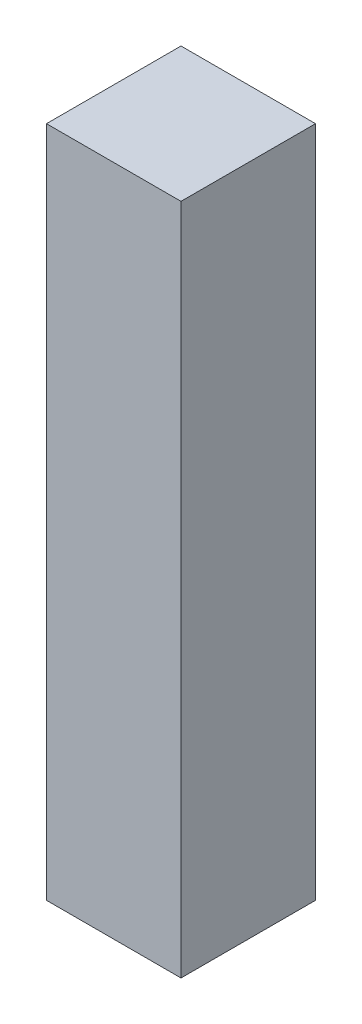
ISO-10303-21;
HEADER;
FILE_DESCRIPTION(('STEP AP214'),'2;1');
FILE_NAME('part.step','',(''),(''),'','','');
FILE_SCHEMA(('AUTOMOTIVE_DESIGN { 1 0 10303 214 1 1 1 1 }'));
ENDSEC;
DATA;
#1=APPLICATION_CONTEXT('core data for automotive mechanical design processes');
#2=APPLICATION_PROTOCOL_DEFINITION('international standard','automotive_design',2000,#1);
#3=PRODUCT_CONTEXT('',#1,'mechanical');
#4=PRODUCT('Part','Part','',(#3));
#5=PRODUCT_RELATED_PRODUCT_CATEGORY('part','',(#4));
#6=PRODUCT_DEFINITION_FORMATION('','',#4);
#7=PRODUCT_DEFINITION_CONTEXT('part definition',#1,'design');
#8=PRODUCT_DEFINITION('design','',#6,#7);
#9=PRODUCT_DEFINITION_SHAPE('','',#8);
#10=(LENGTH_UNIT() NAMED_UNIT(*) SI_UNIT(.MILLI.,.METRE.));
#11=(NAMED_UNIT(*) PLANE_ANGLE_UNIT() SI_UNIT($,.RADIAN.));
#12=(NAMED_UNIT(*) SI_UNIT($,.STERADIAN.) SOLID_ANGLE_UNIT());
#13=UNCERTAINTY_MEASURE_WITH_UNIT(LENGTH_MEASURE(1.E-05),#10,'distance_accuracy_value','');
#14=(GEOMETRIC_REPRESENTATION_CONTEXT(3) GLOBAL_UNCERTAINTY_ASSIGNED_CONTEXT((#13)) GLOBAL_UNIT_ASSIGNED_CONTEXT((#10,
#11,#12)) REPRESENTATION_CONTEXT('',''));
#15=CARTESIAN_POINT('',(0.,0.,0.));
#16=DIRECTION('',(0.,0.,1.));
#17=DIRECTION('',(1.,0.,0.));
#18=AXIS2_PLACEMENT_3D('',#15,#16,#17);
#19=CARTESIAN_POINT('',(-10.2,100.,-8.55));
#20=DIRECTION('',(0.,0.,1.));
#21=DIRECTION('',(1.,0.,0.));
#22=AXIS2_PLACEMENT_3D('',#19,#20,#21);
#23=PLANE('',#22);
#24=DIRECTION('',(-1.,0.,0.));
#25=VECTOR('',#24,1.);
#26=CARTESIAN_POINT('',(-10.2,0.,-8.55));
#27=LINE('',#26,#25);
#28=CARTESIAN_POINT('',(9.79999999999999,0.,-8.55));
#29=VERTEX_POINT('',#28);
#30=CARTESIAN_POINT('',(-10.2,0.,-8.55));
#31=VERTEX_POINT('',#30);
#32=EDGE_CURVE('E100',#29,#31,#27,.T.);
#33=ORIENTED_EDGE('',*,*,#32,.T.);
#34=DIRECTION('',(0.,-1.,0.));
#35=VECTOR('',#34,1.);
#36=CARTESIAN_POINT('',(-10.2,100.,-8.55));
#37=LINE('',#36,#35);
#38=CARTESIAN_POINT('',(-10.2,100.,-8.55));
#39=VERTEX_POINT('',#38);
#40=EDGE_CURVE('E11',#39,#31,#37,.T.);
#41=ORIENTED_EDGE('',*,*,#40,.F.);
#42=DIRECTION('',(-1.,0.,0.));
#43=VECTOR('',#42,1.);
#44=CARTESIAN_POINT('',(-10.2,100.,-8.55));
#45=LINE('',#44,#43);
#46=CARTESIAN_POINT('',(9.79999999999999,100.,-8.55));
#47=VERTEX_POINT('',#46);
#48=EDGE_CURVE('E88',#47,#39,#45,.T.);
#49=ORIENTED_EDGE('',*,*,#48,.F.);
#50=DIRECTION('',(0.,-1.,0.));
#51=VECTOR('',#50,1.);
#52=CARTESIAN_POINT('',(9.79999999999999,100.,-8.55));
#53=LINE('',#52,#51);
#54=EDGE_CURVE('E96',#47,#29,#53,.T.);
#55=ORIENTED_EDGE('',*,*,#54,.T.);
#56=EDGE_LOOP('',(#33,#41,#49,#55));
#57=FACE_BOUND('',#56,.T.);
#58=ADVANCED_FACE('F37',(#57),#23,.F.);
#59=CARTESIAN_POINT('',(-10.2,100.,-8.55));
#60=DIRECTION('',(1.,0.,0.));
#61=DIRECTION('',(0.,0.,-1.));
#62=AXIS2_PLACEMENT_3D('',#59,#60,#61);
#63=PLANE('',#62);
#64=DIRECTION('',(0.,0.,1.));
#65=VECTOR('',#64,1.);
#66=CARTESIAN_POINT('',(-10.2,0.,-8.55));
#67=LINE('',#66,#65);
#68=CARTESIAN_POINT('',(-10.2,0.,11.45));
#69=VERTEX_POINT('',#68);
#70=EDGE_CURVE('E92',#31,#69,#67,.T.);
#71=ORIENTED_EDGE('',*,*,#70,.T.);
#72=DIRECTION('',(0.,-1.,0.));
#73=VECTOR('',#72,1.);
#74=CARTESIAN_POINT('',(-10.2,100.,11.45));
#75=LINE('',#74,#73);
#76=CARTESIAN_POINT('',(-10.2,100.,11.45));
#77=VERTEX_POINT('',#76);
#78=EDGE_CURVE('E45',#77,#69,#75,.T.);
#79=ORIENTED_EDGE('',*,*,#78,.F.);
#80=DIRECTION('',(0.,0.,1.));
#81=VECTOR('',#80,1.);
#82=CARTESIAN_POINT('',(-10.2,100.,-8.55));
#83=LINE('',#82,#81);
#84=EDGE_CURVE('E83',#39,#77,#83,.T.);
#85=ORIENTED_EDGE('',*,*,#84,.F.);
#86=ORIENTED_EDGE('',*,*,#40,.T.);
#87=EDGE_LOOP('',(#71,#79,#85,#86));
#88=FACE_BOUND('',#87,.T.);
#89=ADVANCED_FACE('F91',(#88),#63,.F.);
#90=CARTESIAN_POINT('',(-10.2,100.,11.45));
#91=DIRECTION('',(0.,0.,-1.));
#92=DIRECTION('',(-1.,0.,0.));
#93=AXIS2_PLACEMENT_3D('',#90,#91,#92);
#94=PLANE('',#93);
#95=DIRECTION('',(1.,0.,0.));
#96=VECTOR('',#95,1.);
#97=CARTESIAN_POINT('',(-10.2,0.,11.45));
#98=LINE('',#97,#96);
#99=CARTESIAN_POINT('',(9.79999999999999,0.,11.45));
#100=VERTEX_POINT('',#99);
#101=EDGE_CURVE('E70',#69,#100,#98,.T.);
#102=ORIENTED_EDGE('',*,*,#101,.T.);
#103=DIRECTION('',(0.,-1.,0.));
#104=VECTOR('',#103,1.);
#105=CARTESIAN_POINT('',(9.79999999999999,100.,11.45));
#106=LINE('',#105,#104);
#107=CARTESIAN_POINT('',(9.79999999999999,100.,11.45));
#108=VERTEX_POINT('',#107);
#109=EDGE_CURVE('E93',#108,#100,#106,.T.);
#110=ORIENTED_EDGE('',*,*,#109,.F.);
#111=DIRECTION('',(1.,0.,0.));
#112=VECTOR('',#111,1.);
#113=CARTESIAN_POINT('',(-10.2,100.,11.45));
#114=LINE('',#113,#112);
#115=EDGE_CURVE('E86',#77,#108,#114,.T.);
#116=ORIENTED_EDGE('',*,*,#115,.F.);
#117=ORIENTED_EDGE('',*,*,#78,.T.);
#118=EDGE_LOOP('',(#102,#110,#116,#117));
#119=FACE_BOUND('',#118,.T.);
#120=ADVANCED_FACE('F94',(#119),#94,.F.);
#121=CARTESIAN_POINT('',(9.79999999999999,100.,-8.55));
#122=DIRECTION('',(-1.,0.,0.));
#123=DIRECTION('',(0.,0.,1.));
#124=AXIS2_PLACEMENT_3D('',#121,#122,#123);
#125=PLANE('',#124);
#126=DIRECTION('',(0.,0.,-1.));
#127=VECTOR('',#126,1.);
#128=CARTESIAN_POINT('',(9.79999999999999,0.,-8.55));
#129=LINE('',#128,#127);
#130=EDGE_CURVE('E76',#100,#29,#129,.T.);
#131=ORIENTED_EDGE('',*,*,#130,.T.);
#132=ORIENTED_EDGE('',*,*,#54,.F.);
#133=DIRECTION('',(0.,0.,-1.));
#134=VECTOR('',#133,1.);
#135=CARTESIAN_POINT('',(9.79999999999999,100.,-8.55));
#136=LINE('',#135,#134);
#137=EDGE_CURVE('E53',#108,#47,#136,.T.);
#138=ORIENTED_EDGE('',*,*,#137,.F.);
#139=ORIENTED_EDGE('',*,*,#109,.T.);
#140=EDGE_LOOP('',(#131,#132,#138,#139));
#141=FACE_BOUND('',#140,.T.);
#142=ADVANCED_FACE('F107',(#141),#125,.F.);
#143=CARTESIAN_POINT('',(0.,100.,0.));
#144=DIRECTION('',(0.,-1.,0.));
#145=DIRECTION('',(0.,0.,-1.));
#146=AXIS2_PLACEMENT_3D('',#143,#144,#145);
#147=PLANE('',#146);
#148=ORIENTED_EDGE('',*,*,#48,.T.);
#149=ORIENTED_EDGE('',*,*,#84,.T.);
#150=ORIENTED_EDGE('',*,*,#115,.T.);
#151=ORIENTED_EDGE('',*,*,#137,.T.);
#152=EDGE_LOOP('',(#148,#149,#150,#151));
#153=FACE_BOUND('',#152,.T.);
#154=ADVANCED_FACE('F84',(#153),#147,.F.);
#155=CARTESIAN_POINT('',(0.,0.,0.));
#156=DIRECTION('',(0.,-1.,0.));
#157=DIRECTION('',(0.,0.,-1.));
#158=AXIS2_PLACEMENT_3D('',#155,#156,#157);
#159=PLANE('',#158);
#160=ORIENTED_EDGE('',*,*,#32,.F.);
#161=ORIENTED_EDGE('',*,*,#130,.F.);
#162=ORIENTED_EDGE('',*,*,#101,.F.);
#163=ORIENTED_EDGE('',*,*,#70,.F.);
#164=EDGE_LOOP('',(#160,#161,#162,#163));
#165=FACE_BOUND('',#164,.T.);
#166=ADVANCED_FACE('F110',(#165),#159,.T.);
#167=CLOSED_SHELL('',(#58,#89,#120,#142,#154,#166));
#168=MANIFOLD_SOLID_BREP('B2',#167);
#169=ADVANCED_BREP_SHAPE_REPRESENTATION('',(#18,#168),#14);
#170=SHAPE_DEFINITION_REPRESENTATION(#9,#169);
ENDSEC;
END-ISO-10303-21;
